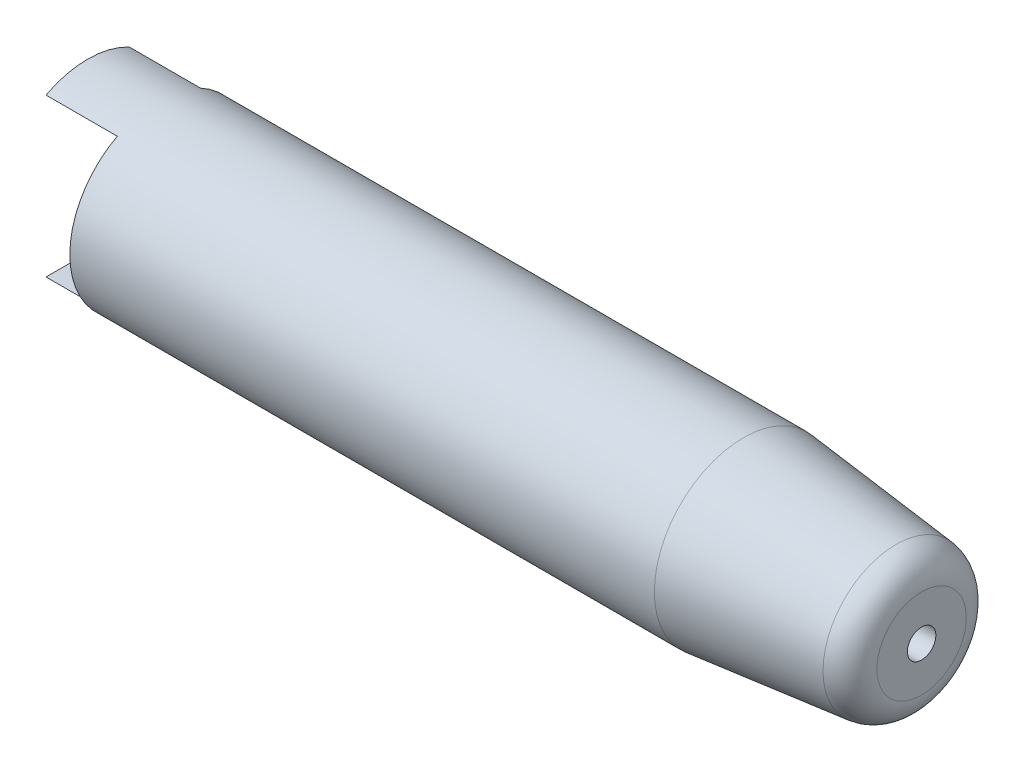
ISO-10303-21;
HEADER;
FILE_DESCRIPTION(('STEP AP214'),'2;1');
FILE_NAME('part.step','',(''),(''),'','','');
FILE_SCHEMA(('AUTOMOTIVE_DESIGN { 1 0 10303 214 1 1 1 1 }'));
ENDSEC;
DATA;
#1=APPLICATION_CONTEXT('core data for automotive mechanical design processes');
#2=APPLICATION_PROTOCOL_DEFINITION('international standard','automotive_design',2000,#1);
#3=PRODUCT_CONTEXT('',#1,'mechanical');
#4=PRODUCT('Part','Part','',(#3));
#5=PRODUCT_RELATED_PRODUCT_CATEGORY('part','',(#4));
#6=PRODUCT_DEFINITION_FORMATION('','',#4);
#7=PRODUCT_DEFINITION_CONTEXT('part definition',#1,'design');
#8=PRODUCT_DEFINITION('design','',#6,#7);
#9=PRODUCT_DEFINITION_SHAPE('','',#8);
#10=(LENGTH_UNIT() NAMED_UNIT(*) SI_UNIT(.MILLI.,.METRE.));
#11=(NAMED_UNIT(*) PLANE_ANGLE_UNIT() SI_UNIT($,.RADIAN.));
#12=(NAMED_UNIT(*) SI_UNIT($,.STERADIAN.) SOLID_ANGLE_UNIT());
#13=UNCERTAINTY_MEASURE_WITH_UNIT(LENGTH_MEASURE(1.E-05),#10,'distance_accuracy_value','');
#14=(GEOMETRIC_REPRESENTATION_CONTEXT(3) GLOBAL_UNCERTAINTY_ASSIGNED_CONTEXT((#13)) GLOBAL_UNIT_ASSIGNED_CONTEXT((#10,
#11,#12)) REPRESENTATION_CONTEXT('',''));
#15=CARTESIAN_POINT('',(0.,0.,0.));
#16=DIRECTION('',(0.,0.,1.));
#17=DIRECTION('',(1.,0.,0.));
#18=AXIS2_PLACEMENT_3D('',#15,#16,#17);
#19=CARTESIAN_POINT('',(0.,0.,0.));
#20=DIRECTION('',(-1.,0.,0.));
#21=DIRECTION('',(0.,0.,1.));
#22=AXIS2_PLACEMENT_3D('',#19,#20,#21);
#23=CYLINDRICAL_SURFACE('',#22,10.);
#24=CARTESIAN_POINT('',(52.,0.,0.));
#25=DIRECTION('',(-1.,0.,0.));
#26=DIRECTION('',(0.,0.,1.));
#27=AXIS2_PLACEMENT_3D('',#24,#25,#26);
#28=CIRCLE('',#27,10.);
#29=CARTESIAN_POINT('',(52.,0.,10.));
#30=VERTEX_POINT('',#29);
#31=EDGE_CURVE('E117',#30,#30,#28,.T.);
#32=ORIENTED_EDGE('',*,*,#31,.F.);
#33=EDGE_LOOP('',(#32));
#34=FACE_BOUND('',#33,.T.);
#35=CARTESIAN_POINT('',(10.,0.,0.));
#36=DIRECTION('',(-1.,0.,0.));
#37=DIRECTION('',(0.,-1.,0.));
#38=AXIS2_PLACEMENT_3D('',#35,#36,#37);
#39=CIRCLE('',#38,10.);
#40=CARTESIAN_POINT('',(10.,-10.,0.));
#41=VERTEX_POINT('',#40);
#42=EDGE_CURVE('E141',#41,#41,#39,.F.);
#43=ORIENTED_EDGE('',*,*,#42,.F.);
#44=EDGE_LOOP('',(#43));
#45=FACE_BOUND('',#44,.T.);
#46=ADVANCED_FACE('F45',(#34,#45),#23,.F.);
#47=CARTESIAN_POINT('',(0.,12.5,0.));
#48=DIRECTION('',(1.,0.,0.));
#49=DIRECTION('',(0.,0.,-1.));
#50=AXIS2_PLACEMENT_3D('',#47,#48,#49);
#51=PLANE('',#50);
#52=DIRECTION('',(0.,0.,1.));
#53=VECTOR('',#52,1.);
#54=CARTESIAN_POINT('',(0.,-11.05,-15.));
#55=LINE('',#54,#53);
#56=CARTESIAN_POINT('',(0.,-11.05,-5.84358622765165));
#57=VERTEX_POINT('',#56);
#58=CARTESIAN_POINT('',(0.,-11.05,5.84358622765165));
#59=VERTEX_POINT('',#58);
#60=EDGE_CURVE('E67',#57,#59,#55,.T.);
#61=ORIENTED_EDGE('',*,*,#60,.F.);
#62=CARTESIAN_POINT('',(0.,0.,0.));
#63=DIRECTION('',(-1.,0.,0.));
#64=DIRECTION('',(0.,0.,1.));
#65=AXIS2_PLACEMENT_3D('',#62,#63,#64);
#66=CIRCLE('',#65,12.5);
#67=EDGE_CURVE('E103',#57,#59,#66,.T.);
#68=ORIENTED_EDGE('',*,*,#67,.T.);
#69=EDGE_LOOP('',(#61,#68));
#70=FACE_BOUND('',#69,.T.);
#71=ADVANCED_FACE('F137',(#70),#51,.F.);
#72=DIRECTION('',(0.,0.,1.));
#73=VECTOR('',#72,1.);
#74=CARTESIAN_POINT('',(0.,11.05,-15.));
#75=LINE('',#74,#73);
#76=CARTESIAN_POINT('',(0.,11.05,-5.84358622765165));
#77=VERTEX_POINT('',#76);
#78=CARTESIAN_POINT('',(0.,11.05,5.84358622765165));
#79=VERTEX_POINT('',#78);
#80=EDGE_CURVE('E110',#77,#79,#75,.T.);
#81=ORIENTED_EDGE('',*,*,#80,.T.);
#82=EDGE_CURVE('E115',#79,#77,#66,.T.);
#83=ORIENTED_EDGE('',*,*,#82,.T.);
#84=EDGE_LOOP('',(#81,#83));
#85=FACE_BOUND('',#84,.T.);
#86=ADVANCED_FACE('F114',(#85),#51,.F.);
#87=CARTESIAN_POINT('',(0.,0.,0.));
#88=DIRECTION('',(-1.,0.,0.));
#89=DIRECTION('',(0.,0.,1.));
#90=AXIS2_PLACEMENT_3D('',#87,#88,#89);
#91=CYLINDRICAL_SURFACE('',#90,12.5);
#92=CARTESIAN_POINT('',(92.,0.,0.));
#93=DIRECTION('',(-1.,0.,0.));
#94=DIRECTION('',(0.,0.,1.));
#95=AXIS2_PLACEMENT_3D('',#92,#93,#94);
#96=CIRCLE('',#95,12.5);
#97=CARTESIAN_POINT('',(92.,0.,12.5));
#98=VERTEX_POINT('',#97);
#99=EDGE_CURVE('E121',#98,#98,#96,.T.);
#100=ORIENTED_EDGE('',*,*,#99,.T.);
#101=EDGE_LOOP('',(#100));
#102=FACE_BOUND('',#101,.T.);
#103=DIRECTION('',(-1.,0.,0.));
#104=VECTOR('',#103,1.);
#105=CARTESIAN_POINT('',(0.,-11.05,5.84358622765165));
#106=LINE('',#105,#104);
#107=CARTESIAN_POINT('',(10.,-11.05,5.84358622765165));
#108=VERTEX_POINT('',#107);
#109=EDGE_CURVE('E13',#59,#108,#106,.F.);
#110=ORIENTED_EDGE('',*,*,#109,.F.);
#111=ORIENTED_EDGE('',*,*,#67,.F.);
#112=DIRECTION('',(-1.,0.,0.));
#113=VECTOR('',#112,1.);
#114=CARTESIAN_POINT('',(0.,-11.05,-5.84358622765165));
#115=LINE('',#114,#113);
#116=CARTESIAN_POINT('',(10.,-11.05,-5.84358622765165));
#117=VERTEX_POINT('',#116);
#118=EDGE_CURVE('E98',#117,#57,#115,.T.);
#119=ORIENTED_EDGE('',*,*,#118,.F.);
#120=CARTESIAN_POINT('',(10.,0.,0.));
#121=DIRECTION('',(-1.,0.,0.));
#122=DIRECTION('',(0.,-1.,0.));
#123=AXIS2_PLACEMENT_3D('',#120,#121,#122);
#124=CIRCLE('',#123,12.5);
#125=CARTESIAN_POINT('',(10.,11.05,-5.84358622765164));
#126=VERTEX_POINT('',#125);
#127=EDGE_CURVE('E84',#126,#117,#124,.T.);
#128=ORIENTED_EDGE('',*,*,#127,.F.);
#129=DIRECTION('',(-1.,0.,0.));
#130=VECTOR('',#129,1.);
#131=CARTESIAN_POINT('',(0.,11.05,-5.84358622765165));
#132=LINE('',#131,#130);
#133=EDGE_CURVE('E93',#77,#126,#132,.F.);
#134=ORIENTED_EDGE('',*,*,#133,.F.);
#135=ORIENTED_EDGE('',*,*,#82,.F.);
#136=DIRECTION('',(-1.,0.,0.));
#137=VECTOR('',#136,1.);
#138=CARTESIAN_POINT('',(0.,11.05,5.84358622765165));
#139=LINE('',#138,#137);
#140=CARTESIAN_POINT('',(10.,11.05,5.84358622765164));
#141=VERTEX_POINT('',#140);
#142=EDGE_CURVE('E53',#141,#79,#139,.T.);
#143=ORIENTED_EDGE('',*,*,#142,.F.);
#144=EDGE_CURVE('E96',#108,#141,#124,.T.);
#145=ORIENTED_EDGE('',*,*,#144,.F.);
#146=EDGE_LOOP('',(#110,#111,#119,#128,#134,#135,#143,#145));
#147=FACE_BOUND('',#146,.T.);
#148=ADVANCED_FACE('F101',(#102,#147),#91,.T.);
#149=CARTESIAN_POINT('',(0.,0.,0.));
#150=DIRECTION('',(-1.,0.,0.));
#151=DIRECTION('',(0.,0.,1.));
#152=AXIS2_PLACEMENT_3D('',#149,#150,#151);
#153=CYLINDRICAL_SURFACE('',#152,2.);
#154=CARTESIAN_POINT('',(117.,0.,0.));
#155=DIRECTION('',(-1.,0.,0.));
#156=DIRECTION('',(0.,0.,1.));
#157=AXIS2_PLACEMENT_3D('',#154,#155,#156);
#158=CIRCLE('',#157,2.);
#159=CARTESIAN_POINT('',(117.,0.,2.));
#160=VERTEX_POINT('',#159);
#161=EDGE_CURVE('E142',#160,#160,#158,.T.);
#162=ORIENTED_EDGE('',*,*,#161,.F.);
#163=EDGE_LOOP('',(#162));
#164=FACE_BOUND('',#163,.T.);
#165=CARTESIAN_POINT('',(56.6188021535171,0.,0.));
#166=DIRECTION('',(-1.,0.,0.));
#167=DIRECTION('',(0.,0.,1.));
#168=AXIS2_PLACEMENT_3D('',#165,#166,#167);
#169=CIRCLE('',#168,2.);
#170=CARTESIAN_POINT('',(56.6188021535171,0.,2.));
#171=VERTEX_POINT('',#170);
#172=EDGE_CURVE('E94',#171,#171,#169,.T.);
#173=ORIENTED_EDGE('',*,*,#172,.T.);
#174=EDGE_LOOP('',(#173));
#175=FACE_BOUND('',#174,.T.);
#176=ADVANCED_FACE('F47',(#164,#175),#153,.F.);
#177=CARTESIAN_POINT('',(52.,0.,0.));
#178=DIRECTION('',(-1.,0.,0.));
#179=DIRECTION('',(0.,0.,1.));
#180=AXIS2_PLACEMENT_3D('',#177,#178,#179);
#181=CONICAL_SURFACE('',#180,10.,1.04719755119659);
#182=ORIENTED_EDGE('',*,*,#172,.F.);
#183=EDGE_LOOP('',(#182));
#184=FACE_BOUND('',#183,.T.);
#185=ORIENTED_EDGE('',*,*,#31,.T.);
#186=EDGE_LOOP('',(#185));
#187=FACE_BOUND('',#186,.T.);
#188=ADVANCED_FACE('F129',(#184,#187),#181,.F.);
#189=CARTESIAN_POINT('',(113.418113853071,0.,0.));
#190=DIRECTION('',(-1.,0.,0.));
#191=DIRECTION('',(0.,0.,1.));
#192=AXIS2_PLACEMENT_3D('',#189,#190,#191);
#193=CONICAL_SURFACE('',#192,10.2488655226398,0.10471975511966);
#194=ORIENTED_EDGE('',*,*,#99,.F.);
#195=EDGE_LOOP('',(#194));
#196=FACE_BOUND('',#195,.T.);
#197=CARTESIAN_POINT('',(113.418113853071,0.,0.));
#198=DIRECTION('',(-1.,0.,0.));
#199=DIRECTION('',(0.,0.,1.));
#200=AXIS2_PLACEMENT_3D('',#197,#198,#199);
#201=CIRCLE('',#200,10.2488655226398);
#202=CARTESIAN_POINT('',(113.418113853071,0.,10.2488655226398));
#203=VERTEX_POINT('',#202);
#204=EDGE_CURVE('E150',#203,#203,#201,.T.);
#205=ORIENTED_EDGE('',*,*,#204,.T.);
#206=EDGE_LOOP('',(#205));
#207=FACE_BOUND('',#206,.T.);
#208=ADVANCED_FACE('F132',(#196,#207),#193,.T.);
#209=CARTESIAN_POINT('',(113.,0.,0.));
#210=DIRECTION('',(-1.,0.,0.));
#211=DIRECTION('',(0.,0.,1.));
#212=AXIS2_PLACEMENT_3D('',#209,#210,#211);
#213=TOROIDAL_SURFACE('',#212,6.27077794116672,4.);
#214=ORIENTED_EDGE('',*,*,#204,.F.);
#215=EDGE_LOOP('',(#214));
#216=FACE_BOUND('',#215,.T.);
#217=CARTESIAN_POINT('',(117.,0.,0.));
#218=DIRECTION('',(-1.,0.,0.));
#219=DIRECTION('',(0.,0.,1.));
#220=AXIS2_PLACEMENT_3D('',#217,#218,#219);
#221=CIRCLE('',#220,6.27077794116672);
#222=CARTESIAN_POINT('',(117.,0.,6.27077794116672));
#223=VERTEX_POINT('',#222);
#224=EDGE_CURVE('E145',#223,#223,#221,.T.);
#225=ORIENTED_EDGE('',*,*,#224,.T.);
#226=EDGE_LOOP('',(#225));
#227=FACE_BOUND('',#226,.T.);
#228=ADVANCED_FACE('F159',(#216,#227),#213,.T.);
#229=CARTESIAN_POINT('',(117.,6.27077794116672,0.));
#230=DIRECTION('',(-1.,0.,0.));
#231=DIRECTION('',(0.,0.,1.));
#232=AXIS2_PLACEMENT_3D('',#229,#230,#231);
#233=PLANE('',#232);
#234=ORIENTED_EDGE('',*,*,#224,.F.);
#235=EDGE_LOOP('',(#234));
#236=FACE_BOUND('',#235,.T.);
#237=ORIENTED_EDGE('',*,*,#161,.T.);
#238=EDGE_LOOP('',(#237));
#239=FACE_BOUND('',#238,.T.);
#240=ADVANCED_FACE('F164',(#236,#239),#233,.F.);
#241=CARTESIAN_POINT('',(10.,-11.05,-15.));
#242=DIRECTION('',(0.,1.,0.));
#243=DIRECTION('',(-1.,0.,0.));
#244=AXIS2_PLACEMENT_3D('',#241,#242,#243);
#245=PLANE('',#244);
#246=ORIENTED_EDGE('',*,*,#118,.T.);
#247=ORIENTED_EDGE('',*,*,#60,.T.);
#248=ORIENTED_EDGE('',*,*,#109,.T.);
#249=DIRECTION('',(0.,0.,1.));
#250=VECTOR('',#249,1.);
#251=CARTESIAN_POINT('',(10.,-11.05,-15.));
#252=LINE('',#251,#250);
#253=EDGE_CURVE('E88',#117,#108,#252,.T.);
#254=ORIENTED_EDGE('',*,*,#253,.F.);
#255=EDGE_LOOP('',(#246,#247,#248,#254));
#256=FACE_BOUND('',#255,.T.);
#257=ADVANCED_FACE('F97',(#256),#245,.T.);
#258=CARTESIAN_POINT('',(0.,11.05,-15.));
#259=DIRECTION('',(0.,-1.,0.));
#260=DIRECTION('',(1.,0.,0.));
#261=AXIS2_PLACEMENT_3D('',#258,#259,#260);
#262=PLANE('',#261);
#263=ORIENTED_EDGE('',*,*,#142,.T.);
#264=ORIENTED_EDGE('',*,*,#80,.F.);
#265=ORIENTED_EDGE('',*,*,#133,.T.);
#266=DIRECTION('',(0.,0.,1.));
#267=VECTOR('',#266,1.);
#268=CARTESIAN_POINT('',(10.,11.05,-15.));
#269=LINE('',#268,#267);
#270=EDGE_CURVE('E60',#126,#141,#269,.T.);
#271=ORIENTED_EDGE('',*,*,#270,.T.);
#272=EDGE_LOOP('',(#263,#264,#265,#271));
#273=FACE_BOUND('',#272,.T.);
#274=ADVANCED_FACE('F109',(#273),#262,.T.);
#275=CARTESIAN_POINT('',(10.,11.05,-15.));
#276=DIRECTION('',(-1.,0.,0.));
#277=DIRECTION('',(0.,-1.,0.));
#278=AXIS2_PLACEMENT_3D('',#275,#276,#277);
#279=PLANE('',#278);
#280=ORIENTED_EDGE('',*,*,#144,.T.);
#281=ORIENTED_EDGE('',*,*,#270,.F.);
#282=ORIENTED_EDGE('',*,*,#127,.T.);
#283=ORIENTED_EDGE('',*,*,#253,.T.);
#284=EDGE_LOOP('',(#280,#281,#282,#283));
#285=FACE_BOUND('',#284,.T.);
#286=ORIENTED_EDGE('',*,*,#42,.T.);
#287=EDGE_LOOP('',(#286));
#288=FACE_BOUND('',#287,.T.);
#289=ADVANCED_FACE('F86',(#285,#288),#279,.T.);
#290=CLOSED_SHELL('',(#46,#71,#86,#148,#176,#188,#208,#228,#240,#257,#274,#289));
#291=MANIFOLD_SOLID_BREP('B2',#290);
#292=ADVANCED_BREP_SHAPE_REPRESENTATION('',(#18,#291),#14);
#293=SHAPE_DEFINITION_REPRESENTATION(#9,#292);
ENDSEC;
END-ISO-10303-21;
